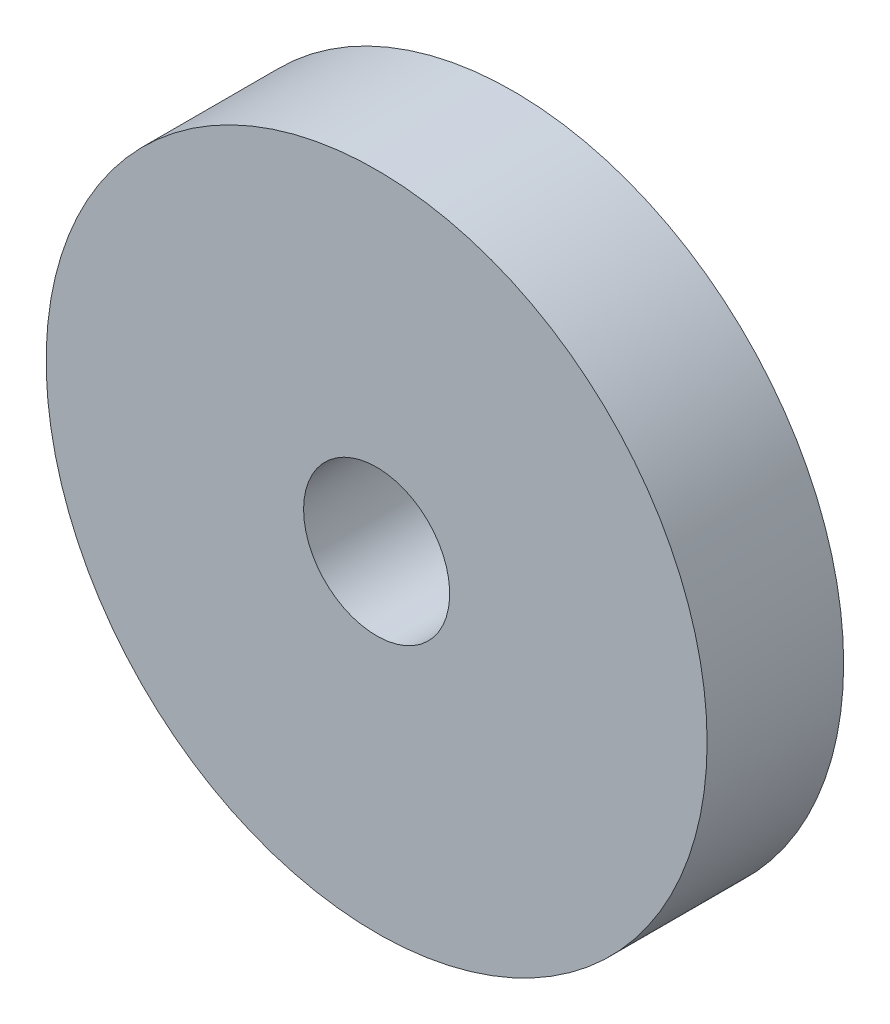
ISO-10303-21;
HEADER;
FILE_DESCRIPTION(('STEP AP214'),'2;1');
FILE_NAME('part.step','',(''),(''),'','','');
FILE_SCHEMA(('AUTOMOTIVE_DESIGN { 1 0 10303 214 1 1 1 1 }'));
ENDSEC;
DATA;
#1=APPLICATION_CONTEXT('core data for automotive mechanical design processes');
#2=APPLICATION_PROTOCOL_DEFINITION('international standard','automotive_design',2000,#1);
#3=PRODUCT_CONTEXT('',#1,'mechanical');
#4=PRODUCT('Part','Part','',(#3));
#5=PRODUCT_RELATED_PRODUCT_CATEGORY('part','',(#4));
#6=PRODUCT_DEFINITION_FORMATION('','',#4);
#7=PRODUCT_DEFINITION_CONTEXT('part definition',#1,'design');
#8=PRODUCT_DEFINITION('design','',#6,#7);
#9=PRODUCT_DEFINITION_SHAPE('','',#8);
#10=(LENGTH_UNIT() NAMED_UNIT(*) SI_UNIT(.MILLI.,.METRE.));
#11=(NAMED_UNIT(*) PLANE_ANGLE_UNIT() SI_UNIT($,.RADIAN.));
#12=(NAMED_UNIT(*) SI_UNIT($,.STERADIAN.) SOLID_ANGLE_UNIT());
#13=UNCERTAINTY_MEASURE_WITH_UNIT(LENGTH_MEASURE(1.E-05),#10,'distance_accuracy_value','');
#14=(GEOMETRIC_REPRESENTATION_CONTEXT(3) GLOBAL_UNCERTAINTY_ASSIGNED_CONTEXT((#13)) GLOBAL_UNIT_ASSIGNED_CONTEXT((#10,
#11,#12)) REPRESENTATION_CONTEXT('',''));
#15=CARTESIAN_POINT('',(0.,0.,0.));
#16=DIRECTION('',(0.,0.,1.));
#17=DIRECTION('',(1.,0.,0.));
#18=AXIS2_PLACEMENT_3D('',#15,#16,#17);
#19=CARTESIAN_POINT('',(0.,29.,50.84));
#20=DIRECTION('',(0.,0.,1.));
#21=DIRECTION('',(1.,0.,0.));
#22=AXIS2_PLACEMENT_3D('',#19,#20,#21);
#23=PLANE('',#22);
#24=CARTESIAN_POINT('',(0.,29.,50.84));
#25=DIRECTION('',(0.,0.,-1.));
#26=DIRECTION('',(-1.,0.,0.));
#27=AXIS2_PLACEMENT_3D('',#24,#25,#26);
#28=CIRCLE('',#27,4.2);
#29=CARTESIAN_POINT('',(-4.19999999999998,29.,50.84));
#30=VERTEX_POINT('',#29);
#31=EDGE_CURVE('E26',#30,#30,#28,.F.);
#32=ORIENTED_EDGE('',*,*,#31,.T.);
#33=EDGE_LOOP('',(#32));
#34=FACE_BOUND('',#33,.T.);
#35=CARTESIAN_POINT('',(0.,29.,50.84));
#36=DIRECTION('',(0.,0.,1.));
#37=DIRECTION('',(1.,0.,0.));
#38=AXIS2_PLACEMENT_3D('',#35,#36,#37);
#39=CIRCLE('',#38,19.);
#40=CARTESIAN_POINT('',(19.,29.,50.84));
#41=VERTEX_POINT('',#40);
#42=EDGE_CURVE('E17',#41,#41,#39,.T.);
#43=ORIENTED_EDGE('',*,*,#42,.F.);
#44=EDGE_LOOP('',(#43));
#45=FACE_BOUND('',#44,.T.);
#46=ADVANCED_FACE('F14',(#34,#45),#23,.F.);
#47=CARTESIAN_POINT('',(0.,29.,50.84));
#48=DIRECTION('',(0.,0.,1.));
#49=DIRECTION('',(1.,0.,0.));
#50=AXIS2_PLACEMENT_3D('',#47,#48,#49);
#51=CYLINDRICAL_SURFACE('',#50,19.);
#52=ORIENTED_EDGE('',*,*,#42,.T.);
#53=EDGE_LOOP('',(#52));
#54=FACE_BOUND('',#53,.T.);
#55=CARTESIAN_POINT('',(0.,29.,58.69));
#56=DIRECTION('',(0.,0.,1.));
#57=DIRECTION('',(1.,0.,0.));
#58=AXIS2_PLACEMENT_3D('',#55,#56,#57);
#59=CIRCLE('',#58,19.);
#60=CARTESIAN_POINT('',(19.,29.,58.69));
#61=VERTEX_POINT('',#60);
#62=EDGE_CURVE('E21',#61,#61,#59,.T.);
#63=ORIENTED_EDGE('',*,*,#62,.F.);
#64=EDGE_LOOP('',(#63));
#65=FACE_BOUND('',#64,.T.);
#66=ADVANCED_FACE('F34',(#54,#65),#51,.T.);
#67=CARTESIAN_POINT('',(0.,29.,63.287));
#68=DIRECTION('',(0.,0.,-1.));
#69=DIRECTION('',(-1.,0.,0.));
#70=AXIS2_PLACEMENT_3D('',#67,#68,#69);
#71=CYLINDRICAL_SURFACE('',#70,4.2);
#72=ORIENTED_EDGE('',*,*,#31,.F.);
#73=EDGE_LOOP('',(#72));
#74=FACE_BOUND('',#73,.T.);
#75=CARTESIAN_POINT('',(0.,29.,58.69));
#76=DIRECTION('',(0.,0.,-1.));
#77=DIRECTION('',(-1.,0.,0.));
#78=AXIS2_PLACEMENT_3D('',#75,#76,#77);
#79=CIRCLE('',#78,4.2);
#80=CARTESIAN_POINT('',(-4.19999999999998,29.,58.69));
#81=VERTEX_POINT('',#80);
#82=EDGE_CURVE('E10',#81,#81,#79,.T.);
#83=ORIENTED_EDGE('',*,*,#82,.F.);
#84=EDGE_LOOP('',(#83));
#85=FACE_BOUND('',#84,.T.);
#86=ADVANCED_FACE('F42',(#74,#85),#71,.F.);
#87=CARTESIAN_POINT('',(0.,29.,58.69));
#88=DIRECTION('',(0.,0.,1.));
#89=DIRECTION('',(1.,0.,0.));
#90=AXIS2_PLACEMENT_3D('',#87,#88,#89);
#91=PLANE('',#90);
#92=ORIENTED_EDGE('',*,*,#82,.T.);
#93=EDGE_LOOP('',(#92));
#94=FACE_BOUND('',#93,.T.);
#95=ORIENTED_EDGE('',*,*,#62,.T.);
#96=EDGE_LOOP('',(#95));
#97=FACE_BOUND('',#96,.T.);
#98=ADVANCED_FACE('F43',(#94,#97),#91,.T.);
#99=CLOSED_SHELL('',(#46,#66,#86,#98));
#100=MANIFOLD_SOLID_BREP('B1',#99);
#101=ADVANCED_BREP_SHAPE_REPRESENTATION('',(#18,#100),#14);
#102=SHAPE_DEFINITION_REPRESENTATION(#9,#101);
ENDSEC;
END-ISO-10303-21;
